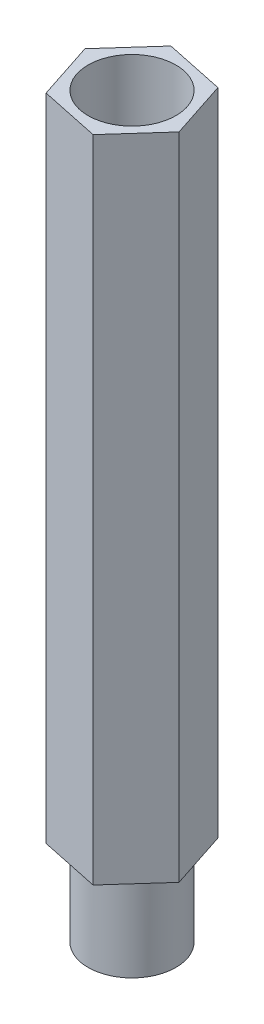
ISO-10303-21;
HEADER;
FILE_DESCRIPTION(('STEP AP214'),'2;1');
FILE_NAME('part.step','',(''),(''),'','','');
FILE_SCHEMA(('AUTOMOTIVE_DESIGN { 1 0 10303 214 1 1 1 1 }'));
ENDSEC;
DATA;
#1=APPLICATION_CONTEXT('core data for automotive mechanical design processes');
#2=APPLICATION_PROTOCOL_DEFINITION('international standard','automotive_design',2000,#1);
#3=PRODUCT_CONTEXT('',#1,'mechanical');
#4=PRODUCT('Part','Part','',(#3));
#5=PRODUCT_RELATED_PRODUCT_CATEGORY('part','',(#4));
#6=PRODUCT_DEFINITION_FORMATION('','',#4);
#7=PRODUCT_DEFINITION_CONTEXT('part definition',#1,'design');
#8=PRODUCT_DEFINITION('design','',#6,#7);
#9=PRODUCT_DEFINITION_SHAPE('','',#8);
#10=(LENGTH_UNIT() NAMED_UNIT(*) SI_UNIT(.MILLI.,.METRE.));
#11=(NAMED_UNIT(*) PLANE_ANGLE_UNIT() SI_UNIT($,.RADIAN.));
#12=(NAMED_UNIT(*) SI_UNIT($,.STERADIAN.) SOLID_ANGLE_UNIT());
#13=UNCERTAINTY_MEASURE_WITH_UNIT(LENGTH_MEASURE(1.E-05),#10,'distance_accuracy_value','');
#14=(GEOMETRIC_REPRESENTATION_CONTEXT(3) GLOBAL_UNCERTAINTY_ASSIGNED_CONTEXT((#13)) GLOBAL_UNIT_ASSIGNED_CONTEXT((#10,
#11,#12)) REPRESENTATION_CONTEXT('',''));
#15=CARTESIAN_POINT('',(0.,0.,0.));
#16=DIRECTION('',(0.,0.,1.));
#17=DIRECTION('',(1.,0.,0.));
#18=AXIS2_PLACEMENT_3D('',#15,#16,#17);
#19=CARTESIAN_POINT('',(0.,-3.53553390593274,0.));
#20=DIRECTION('',(0.,1.,0.));
#21=DIRECTION('',(0.,0.,1.));
#22=AXIS2_PLACEMENT_3D('',#19,#20,#21);
#23=CYLINDRICAL_SURFACE('',#22,1.25);
#24=CARTESIAN_POINT('',(0.,18.5,0.));
#25=DIRECTION('',(0.,1.,0.));
#26=DIRECTION('',(0.,0.,1.));
#27=AXIS2_PLACEMENT_3D('',#24,#25,#26);
#28=CIRCLE('',#27,1.25);
#29=CARTESIAN_POINT('',(0.,18.5,1.25));
#30=VERTEX_POINT('',#29);
#31=EDGE_CURVE('E151',#30,#30,#28,.T.);
#32=ORIENTED_EDGE('',*,*,#31,.T.);
#33=EDGE_LOOP('',(#32));
#34=FACE_BOUND('',#33,.T.);
#35=CARTESIAN_POINT('',(0.,2.5,0.));
#36=DIRECTION('',(0.,-1.,0.));
#37=DIRECTION('',(0.,0.,-1.));
#38=AXIS2_PLACEMENT_3D('',#35,#36,#37);
#39=CIRCLE('',#38,1.25);
#40=CARTESIAN_POINT('',(0.,2.5,-1.25));
#41=VERTEX_POINT('',#40);
#42=EDGE_CURVE('E11',#41,#41,#39,.F.);
#43=ORIENTED_EDGE('',*,*,#42,.F.);
#44=EDGE_LOOP('',(#43));
#45=FACE_BOUND('',#44,.T.);
#46=ADVANCED_FACE('F33',(#34,#45),#23,.F.);
#47=CARTESIAN_POINT('',(1.69496510278067,18.5,0.3565014731466));
#48=DIRECTION('',(-0.950395662134181,0.,0.311043542605423));
#49=DIRECTION('',(0.311043542605423,0.,0.950395662134181));
#50=AXIS2_PLACEMENT_3D('',#47,#48,#49);
#51=PLANE('',#50);
#52=DIRECTION('',(-0.311043542605423,0.,-0.950395662134181));
#53=VECTOR('',#52,1.);
#54=CARTESIAN_POINT('',(1.69496510278067,0.,0.3565014731466));
#55=LINE('',#54,#53);
#56=CARTESIAN_POINT('',(1.69496510278067,0.,0.3565014731466));
#57=VERTEX_POINT('',#56);
#58=CARTESIAN_POINT('',(1.15622188362186,0.,-1.28963210096288));
#59=VERTEX_POINT('',#58);
#60=EDGE_CURVE('E119',#57,#59,#55,.T.);
#61=ORIENTED_EDGE('',*,*,#60,.T.);
#62=DIRECTION('',(0.,-1.,0.));
#63=VECTOR('',#62,1.);
#64=CARTESIAN_POINT('',(1.15622188362186,18.5,-1.28963210096288));
#65=LINE('',#64,#63);
#66=CARTESIAN_POINT('',(1.15622188362186,18.5,-1.28963210096288));
#67=VERTEX_POINT('',#66);
#68=EDGE_CURVE('E42',#67,#59,#65,.T.);
#69=ORIENTED_EDGE('',*,*,#68,.F.);
#70=DIRECTION('',(-0.311043542605423,0.,-0.950395662134181));
#71=VECTOR('',#70,1.);
#72=CARTESIAN_POINT('',(1.69496510278067,18.5,0.3565014731466));
#73=LINE('',#72,#71);
#74=CARTESIAN_POINT('',(1.69496510278067,18.5,0.3565014731466));
#75=VERTEX_POINT('',#74);
#76=EDGE_CURVE('E130',#75,#67,#73,.T.);
#77=ORIENTED_EDGE('',*,*,#76,.F.);
#78=DIRECTION('',(0.,-1.,0.));
#79=VECTOR('',#78,1.);
#80=CARTESIAN_POINT('',(1.69496510278067,18.5,0.3565014731466));
#81=LINE('',#80,#79);
#82=EDGE_CURVE('E115',#75,#57,#81,.T.);
#83=ORIENTED_EDGE('',*,*,#82,.T.);
#84=EDGE_LOOP('',(#61,#69,#77,#83));
#85=FACE_BOUND('',#84,.T.);
#86=ADVANCED_FACE('F35',(#85),#51,.F.);
#87=CARTESIAN_POINT('',(1.15622188362186,18.5,-1.28963210096288));
#88=DIRECTION('',(-0.205826221487679,0.,0.978588558357446));
#89=DIRECTION('',(0.978588558357446,0.,0.205826221487679));
#90=AXIS2_PLACEMENT_3D('',#87,#88,#89);
#91=PLANE('',#90);
#92=DIRECTION('',(-0.978588558357446,0.,-0.205826221487679));
#93=VECTOR('',#92,1.);
#94=CARTESIAN_POINT('',(1.15622188362186,0.,-1.28963210096288));
#95=LINE('',#94,#93);
#96=CARTESIAN_POINT('',(-0.538743219158786,0.,-1.64613357410946));
#97=VERTEX_POINT('',#96);
#98=EDGE_CURVE('E122',#59,#97,#95,.T.);
#99=ORIENTED_EDGE('',*,*,#98,.T.);
#100=DIRECTION('',(0.,-1.,0.));
#101=VECTOR('',#100,1.);
#102=CARTESIAN_POINT('',(-0.538743219158786,18.5,-1.64613357410946));
#103=LINE('',#102,#101);
#104=CARTESIAN_POINT('',(-0.538743219158786,18.5,-1.64613357410946));
#105=VERTEX_POINT('',#104);
#106=EDGE_CURVE('E134',#105,#97,#103,.T.);
#107=ORIENTED_EDGE('',*,*,#106,.F.);
#108=DIRECTION('',(-0.978588558357446,0.,-0.205826221487679));
#109=VECTOR('',#108,1.);
#110=CARTESIAN_POINT('',(1.15622188362186,18.5,-1.28963210096288));
#111=LINE('',#110,#109);
#112=EDGE_CURVE('E88',#67,#105,#111,.T.);
#113=ORIENTED_EDGE('',*,*,#112,.F.);
#114=ORIENTED_EDGE('',*,*,#68,.T.);
#115=EDGE_LOOP('',(#99,#107,#113,#114));
#116=FACE_BOUND('',#115,.T.);
#117=ADVANCED_FACE('F137',(#116),#91,.F.);
#118=CARTESIAN_POINT('',(-0.538743219158786,18.5,-1.64613357410946));
#119=DIRECTION('',(0.744569440646494,0.,0.667545015752023));
#120=DIRECTION('',(0.667545015752023,0.,-0.744569440646493));
#121=AXIS2_PLACEMENT_3D('',#118,#119,#120);
#122=PLANE('',#121);
#123=DIRECTION('',(-0.667545015752022,0.,0.744569440646493));
#124=VECTOR('',#123,1.);
#125=CARTESIAN_POINT('',(-0.538743219158786,0.,-1.64613357410946));
#126=LINE('',#125,#124);
#127=CARTESIAN_POINT('',(-1.69496510278065,0.,-0.356501473146593));
#128=VERTEX_POINT('',#127);
#129=EDGE_CURVE('E125',#97,#128,#126,.T.);
#130=ORIENTED_EDGE('',*,*,#129,.T.);
#131=DIRECTION('',(0.,-1.,0.));
#132=VECTOR('',#131,1.);
#133=CARTESIAN_POINT('',(-1.69496510278065,18.5,-0.356501473146593));
#134=LINE('',#133,#132);
#135=CARTESIAN_POINT('',(-1.69496510278065,18.5,-0.356501473146593));
#136=VERTEX_POINT('',#135);
#137=EDGE_CURVE('E110',#136,#128,#134,.T.);
#138=ORIENTED_EDGE('',*,*,#137,.F.);
#139=DIRECTION('',(-0.667545015752022,0.,0.744569440646493));
#140=VECTOR('',#139,1.);
#141=CARTESIAN_POINT('',(-0.538743219158786,18.5,-1.64613357410946));
#142=LINE('',#141,#140);
#143=EDGE_CURVE('E101',#105,#136,#142,.T.);
#144=ORIENTED_EDGE('',*,*,#143,.F.);
#145=ORIENTED_EDGE('',*,*,#106,.T.);
#146=EDGE_LOOP('',(#130,#138,#144,#145));
#147=FACE_BOUND('',#146,.T.);
#148=ADVANCED_FACE('F145',(#147),#122,.F.);
#149=CARTESIAN_POINT('',(-1.69496510278065,18.5,-0.356501473146593));
#150=DIRECTION('',(0.950395662134181,0.,-0.311043542605424));
#151=DIRECTION('',(-0.311043542605424,0.,-0.950395662134181));
#152=AXIS2_PLACEMENT_3D('',#149,#150,#151);
#153=PLANE('',#152);
#154=DIRECTION('',(0.311043542605424,0.,0.950395662134181));
#155=VECTOR('',#154,1.);
#156=CARTESIAN_POINT('',(-1.69496510278065,0.,-0.356501473146593));
#157=LINE('',#156,#155);
#158=CARTESIAN_POINT('',(-1.15622188362184,0.,1.28963210096288));
#159=VERTEX_POINT('',#158);
#160=EDGE_CURVE('E109',#128,#159,#157,.T.);
#161=ORIENTED_EDGE('',*,*,#160,.T.);
#162=DIRECTION('',(0.,-1.,0.));
#163=VECTOR('',#162,1.);
#164=CARTESIAN_POINT('',(-1.15622188362184,18.5,1.28963210096288));
#165=LINE('',#164,#163);
#166=CARTESIAN_POINT('',(-1.15622188362184,18.5,1.28963210096288));
#167=VERTEX_POINT('',#166);
#168=EDGE_CURVE('E106',#167,#159,#165,.T.);
#169=ORIENTED_EDGE('',*,*,#168,.F.);
#170=DIRECTION('',(0.311043542605424,0.,0.950395662134181));
#171=VECTOR('',#170,1.);
#172=CARTESIAN_POINT('',(-1.69496510278065,18.5,-0.356501473146593));
#173=LINE('',#172,#171);
#174=EDGE_CURVE('E95',#136,#167,#173,.T.);
#175=ORIENTED_EDGE('',*,*,#174,.F.);
#176=ORIENTED_EDGE('',*,*,#137,.T.);
#177=EDGE_LOOP('',(#161,#169,#175,#176));
#178=FACE_BOUND('',#177,.T.);
#179=ADVANCED_FACE('F107',(#178),#153,.F.);
#180=CARTESIAN_POINT('',(-1.15622188362184,18.5,1.28963210096288));
#181=DIRECTION('',(0.205826221487685,0.,-0.978588558357445));
#182=DIRECTION('',(-0.978588558357445,0.,-0.205826221487685));
#183=AXIS2_PLACEMENT_3D('',#180,#181,#182);
#184=PLANE('',#183);
#185=DIRECTION('',(0.978588558357445,0.,0.205826221487685));
#186=VECTOR('',#185,1.);
#187=CARTESIAN_POINT('',(-1.15622188362184,0.,1.28963210096288));
#188=LINE('',#187,#186);
#189=CARTESIAN_POINT('',(0.538743219158797,0.,1.64613357410946));
#190=VERTEX_POINT('',#189);
#191=EDGE_CURVE('E73',#159,#190,#188,.T.);
#192=ORIENTED_EDGE('',*,*,#191,.T.);
#193=DIRECTION('',(0.,-1.,0.));
#194=VECTOR('',#193,1.);
#195=CARTESIAN_POINT('',(0.538743219158797,18.5,1.64613357410946));
#196=LINE('',#195,#194);
#197=CARTESIAN_POINT('',(0.538743219158797,18.5,1.64613357410946));
#198=VERTEX_POINT('',#197);
#199=EDGE_CURVE('E111',#198,#190,#196,.T.);
#200=ORIENTED_EDGE('',*,*,#199,.F.);
#201=DIRECTION('',(0.978588558357445,0.,0.205826221487685));
#202=VECTOR('',#201,1.);
#203=CARTESIAN_POINT('',(-1.15622188362184,18.5,1.28963210096288));
#204=LINE('',#203,#202);
#205=EDGE_CURVE('E99',#167,#198,#204,.T.);
#206=ORIENTED_EDGE('',*,*,#205,.F.);
#207=ORIENTED_EDGE('',*,*,#168,.T.);
#208=EDGE_LOOP('',(#192,#200,#206,#207));
#209=FACE_BOUND('',#208,.T.);
#210=ADVANCED_FACE('F113',(#209),#184,.F.);
#211=CARTESIAN_POINT('',(0.538743219158797,18.5,1.64613357410946));
#212=DIRECTION('',(-0.74456944064649,0.,-0.667545015752026));
#213=DIRECTION('',(-0.667545015752026,0.,0.74456944064649));
#214=AXIS2_PLACEMENT_3D('',#211,#212,#213);
#215=PLANE('',#214);
#216=DIRECTION('',(0.667545015752026,0.,-0.74456944064649));
#217=VECTOR('',#216,1.);
#218=CARTESIAN_POINT('',(0.538743219158797,0.,1.64613357410946));
#219=LINE('',#218,#217);
#220=EDGE_CURVE('E79',#190,#57,#219,.T.);
#221=ORIENTED_EDGE('',*,*,#220,.T.);
#222=ORIENTED_EDGE('',*,*,#82,.F.);
#223=DIRECTION('',(0.667545015752026,0.,-0.74456944064649));
#224=VECTOR('',#223,1.);
#225=CARTESIAN_POINT('',(0.538743219158797,18.5,1.64613357410946));
#226=LINE('',#225,#224);
#227=EDGE_CURVE('E50',#198,#75,#226,.T.);
#228=ORIENTED_EDGE('',*,*,#227,.F.);
#229=ORIENTED_EDGE('',*,*,#199,.T.);
#230=EDGE_LOOP('',(#221,#222,#228,#229));
#231=FACE_BOUND('',#230,.T.);
#232=ADVANCED_FACE('F175',(#231),#215,.F.);
#233=CARTESIAN_POINT('',(0.,18.5,0.));
#234=DIRECTION('',(0.,1.,0.));
#235=DIRECTION('',(0.,0.,1.));
#236=AXIS2_PLACEMENT_3D('',#233,#234,#235);
#237=PLANE('',#236);
#238=ORIENTED_EDGE('',*,*,#31,.F.);
#239=EDGE_LOOP('',(#238));
#240=FACE_BOUND('',#239,.T.);
#241=ORIENTED_EDGE('',*,*,#76,.T.);
#242=ORIENTED_EDGE('',*,*,#112,.T.);
#243=ORIENTED_EDGE('',*,*,#143,.T.);
#244=ORIENTED_EDGE('',*,*,#174,.T.);
#245=ORIENTED_EDGE('',*,*,#205,.T.);
#246=ORIENTED_EDGE('',*,*,#227,.T.);
#247=EDGE_LOOP('',(#241,#242,#243,#244,#245,#246));
#248=FACE_BOUND('',#247,.T.);
#249=ADVANCED_FACE('F97',(#240,#248),#237,.T.);
#250=CARTESIAN_POINT('',(0.,0.,0.));
#251=DIRECTION('',(0.,1.,0.));
#252=DIRECTION('',(0.,0.,1.));
#253=AXIS2_PLACEMENT_3D('',#250,#251,#252);
#254=PLANE('',#253);
#255=CARTESIAN_POINT('',(0.,0.,0.));
#256=DIRECTION('',(0.,1.,0.));
#257=DIRECTION('',(0.,0.,1.));
#258=AXIS2_PLACEMENT_3D('',#255,#256,#257);
#259=CIRCLE('',#258,1.25);
#260=CARTESIAN_POINT('',(0.,0.,1.25));
#261=VERTEX_POINT('',#260);
#262=EDGE_CURVE('E123',#261,#261,#259,.F.);
#263=ORIENTED_EDGE('',*,*,#262,.F.);
#264=EDGE_LOOP('',(#263));
#265=FACE_BOUND('',#264,.T.);
#266=ORIENTED_EDGE('',*,*,#60,.F.);
#267=ORIENTED_EDGE('',*,*,#220,.F.);
#268=ORIENTED_EDGE('',*,*,#191,.F.);
#269=ORIENTED_EDGE('',*,*,#160,.F.);
#270=ORIENTED_EDGE('',*,*,#129,.F.);
#271=ORIENTED_EDGE('',*,*,#98,.F.);
#272=EDGE_LOOP('',(#266,#267,#268,#269,#270,#271));
#273=FACE_BOUND('',#272,.T.);
#274=ADVANCED_FACE('F142',(#265,#273),#254,.F.);
#275=CARTESIAN_POINT('',(0.,2.5,0.));
#276=DIRECTION('',(0.,-1.,0.));
#277=DIRECTION('',(0.,0.,-1.));
#278=AXIS2_PLACEMENT_3D('',#275,#276,#277);
#279=PLANE('',#278);
#280=ORIENTED_EDGE('',*,*,#42,.T.);
#281=EDGE_LOOP('',(#280));
#282=FACE_BOUND('',#281,.T.);
#283=ADVANCED_FACE('F163',(#282),#279,.F.);
#284=CARTESIAN_POINT('',(0.,2.5,0.));
#285=DIRECTION('',(0.,-1.,0.));
#286=DIRECTION('',(0.,0.,-1.));
#287=AXIS2_PLACEMENT_3D('',#284,#285,#286);
#288=CYLINDRICAL_SURFACE('',#287,1.25);
#289=CARTESIAN_POINT('',(0.,-2.5,0.));
#290=DIRECTION('',(0.,-1.,0.));
#291=DIRECTION('',(0.,0.,-1.));
#292=AXIS2_PLACEMENT_3D('',#289,#290,#291);
#293=CIRCLE('',#292,1.25);
#294=CARTESIAN_POINT('',(0.,-2.5,-1.25));
#295=VERTEX_POINT('',#294);
#296=EDGE_CURVE('E154',#295,#295,#293,.T.);
#297=ORIENTED_EDGE('',*,*,#296,.F.);
#298=EDGE_LOOP('',(#297));
#299=FACE_BOUND('',#298,.T.);
#300=ORIENTED_EDGE('',*,*,#262,.T.);
#301=EDGE_LOOP('',(#300));
#302=FACE_BOUND('',#301,.T.);
#303=ADVANCED_FACE('F160',(#299,#302),#288,.T.);
#304=CARTESIAN_POINT('',(0.,-2.5,0.));
#305=DIRECTION('',(0.,-1.,0.));
#306=DIRECTION('',(0.,0.,-1.));
#307=AXIS2_PLACEMENT_3D('',#304,#305,#306);
#308=PLANE('',#307);
#309=ORIENTED_EDGE('',*,*,#296,.T.);
#310=EDGE_LOOP('',(#309));
#311=FACE_BOUND('',#310,.T.);
#312=ADVANCED_FACE('F158',(#311),#308,.T.);
#313=CLOSED_SHELL('',(#46,#86,#117,#148,#179,#210,#232,#249,#274,#283,#303,#312));
#314=MANIFOLD_SOLID_BREP('B2',#313);
#315=ADVANCED_BREP_SHAPE_REPRESENTATION('',(#18,#314),#14);
#316=SHAPE_DEFINITION_REPRESENTATION(#9,#315);
ENDSEC;
END-ISO-10303-21;
